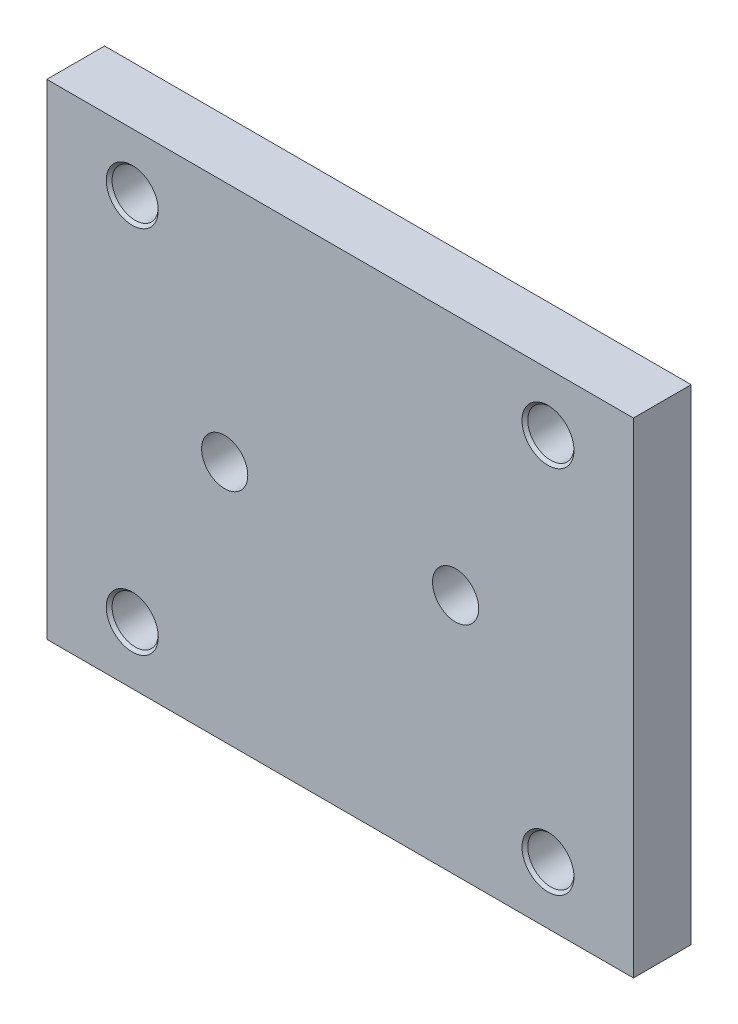
ISO-10303-21;
HEADER;
FILE_DESCRIPTION(('STEP AP214'),'2;1');
FILE_NAME('part.step','',(''),(''),'','','');
FILE_SCHEMA(('AUTOMOTIVE_DESIGN { 1 0 10303 214 1 1 1 1 }'));
ENDSEC;
DATA;
#1=APPLICATION_CONTEXT('core data for automotive mechanical design processes');
#2=APPLICATION_PROTOCOL_DEFINITION('international standard','automotive_design',2000,#1);
#3=PRODUCT_CONTEXT('',#1,'mechanical');
#4=PRODUCT('Part','Part','',(#3));
#5=PRODUCT_RELATED_PRODUCT_CATEGORY('part','',(#4));
#6=PRODUCT_DEFINITION_FORMATION('','',#4);
#7=PRODUCT_DEFINITION_CONTEXT('part definition',#1,'design');
#8=PRODUCT_DEFINITION('design','',#6,#7);
#9=PRODUCT_DEFINITION_SHAPE('','',#8);
#10=(LENGTH_UNIT() NAMED_UNIT(*) SI_UNIT(.MILLI.,.METRE.));
#11=(NAMED_UNIT(*) PLANE_ANGLE_UNIT() SI_UNIT($,.RADIAN.));
#12=(NAMED_UNIT(*) SI_UNIT($,.STERADIAN.) SOLID_ANGLE_UNIT());
#13=UNCERTAINTY_MEASURE_WITH_UNIT(LENGTH_MEASURE(1.E-05),#10,'distance_accuracy_value','');
#14=(GEOMETRIC_REPRESENTATION_CONTEXT(3) GLOBAL_UNCERTAINTY_ASSIGNED_CONTEXT((#13)) GLOBAL_UNIT_ASSIGNED_CONTEXT((#10,
#11,#12)) REPRESENTATION_CONTEXT('',''));
#15=CARTESIAN_POINT('',(0.,0.,0.));
#16=DIRECTION('',(0.,0.,1.));
#17=DIRECTION('',(1.,0.,0.));
#18=AXIS2_PLACEMENT_3D('',#15,#16,#17);
#19=CARTESIAN_POINT('',(0.,0.,25.));
#20=DIRECTION('',(0.,0.,1.));
#21=DIRECTION('',(1.,0.,0.));
#22=AXIS2_PLACEMENT_3D('',#19,#20,#21);
#23=PLANE('',#22);
#24=CARTESIAN_POINT('',(-90.,-79.9999999999998,25.));
#25=DIRECTION('',(0.,0.,1.));
#26=DIRECTION('',(1.,0.,0.));
#27=AXIS2_PLACEMENT_3D('',#24,#25,#26);
#28=CIRCLE('',#27,11.25);
#29=CARTESIAN_POINT('',(-78.75,-79.9999999999998,25.));
#30=VERTEX_POINT('',#29);
#31=EDGE_CURVE('E183',#30,#30,#28,.T.);
#32=ORIENTED_EDGE('',*,*,#31,.F.);
#33=EDGE_LOOP('',(#32));
#34=FACE_BOUND('',#33,.T.);
#35=CARTESIAN_POINT('',(90.,-79.9999999999998,25.));
#36=DIRECTION('',(0.,0.,1.));
#37=DIRECTION('',(1.,0.,0.));
#38=AXIS2_PLACEMENT_3D('',#35,#36,#37);
#39=CIRCLE('',#38,11.25);
#40=CARTESIAN_POINT('',(101.25,-79.9999999999998,25.));
#41=VERTEX_POINT('',#40);
#42=EDGE_CURVE('E187',#41,#41,#39,.T.);
#43=ORIENTED_EDGE('',*,*,#42,.F.);
#44=EDGE_LOOP('',(#43));
#45=FACE_BOUND('',#44,.T.);
#46=CARTESIAN_POINT('',(90.,80.0000000000002,25.));
#47=DIRECTION('',(0.,0.,1.));
#48=DIRECTION('',(1.,0.,0.));
#49=AXIS2_PLACEMENT_3D('',#46,#47,#48);
#50=CIRCLE('',#49,11.25);
#51=CARTESIAN_POINT('',(101.25,80.0000000000002,25.));
#52=VERTEX_POINT('',#51);
#53=EDGE_CURVE('E182',#52,#52,#50,.T.);
#54=ORIENTED_EDGE('',*,*,#53,.F.);
#55=EDGE_LOOP('',(#54));
#56=FACE_BOUND('',#55,.T.);
#57=CARTESIAN_POINT('',(-90.,80.0000000000002,25.));
#58=DIRECTION('',(0.,0.,1.));
#59=DIRECTION('',(1.,0.,0.));
#60=AXIS2_PLACEMENT_3D('',#57,#58,#59);
#61=CIRCLE('',#60,11.25);
#62=CARTESIAN_POINT('',(-78.75,80.0000000000002,25.));
#63=VERTEX_POINT('',#62);
#64=EDGE_CURVE('E130',#63,#63,#61,.T.);
#65=ORIENTED_EDGE('',*,*,#64,.F.);
#66=EDGE_LOOP('',(#65));
#67=FACE_BOUND('',#66,.T.);
#68=CARTESIAN_POINT('',(-50.,0.,25.));
#69=DIRECTION('',(0.,0.,1.));
#70=DIRECTION('',(1.,0.,0.));
#71=AXIS2_PLACEMENT_3D('',#68,#69,#70);
#72=CIRCLE('',#71,10.);
#73=CARTESIAN_POINT('',(-40.,0.,25.));
#74=VERTEX_POINT('',#73);
#75=EDGE_CURVE('E151',#74,#74,#72,.T.);
#76=ORIENTED_EDGE('',*,*,#75,.F.);
#77=EDGE_LOOP('',(#76));
#78=FACE_BOUND('',#77,.T.);
#79=CARTESIAN_POINT('',(50.,0.,25.));
#80=DIRECTION('',(0.,0.,1.));
#81=DIRECTION('',(1.,0.,0.));
#82=AXIS2_PLACEMENT_3D('',#79,#80,#81);
#83=CIRCLE('',#82,10.);
#84=CARTESIAN_POINT('',(60.,0.,25.));
#85=VERTEX_POINT('',#84);
#86=EDGE_CURVE('E140',#85,#85,#83,.T.);
#87=ORIENTED_EDGE('',*,*,#86,.F.);
#88=EDGE_LOOP('',(#87));
#89=FACE_BOUND('',#88,.T.);
#90=DIRECTION('',(0.,-1.,0.));
#91=VECTOR('',#90,1.);
#92=CARTESIAN_POINT('',(-127.,105.,25.));
#93=LINE('',#92,#91);
#94=CARTESIAN_POINT('',(-127.,105.,25.));
#95=VERTEX_POINT('',#94);
#96=CARTESIAN_POINT('',(-127.,-105.,25.));
#97=VERTEX_POINT('',#96);
#98=EDGE_CURVE('E93',#95,#97,#93,.T.);
#99=ORIENTED_EDGE('',*,*,#98,.T.);
#100=DIRECTION('',(1.,0.,0.));
#101=VECTOR('',#100,1.);
#102=CARTESIAN_POINT('',(-127.,-105.,25.));
#103=LINE('',#102,#101);
#104=CARTESIAN_POINT('',(127.,-105.,25.));
#105=VERTEX_POINT('',#104);
#106=EDGE_CURVE('E89',#97,#105,#103,.T.);
#107=ORIENTED_EDGE('',*,*,#106,.T.);
#108=DIRECTION('',(0.,1.,0.));
#109=VECTOR('',#108,1.);
#110=CARTESIAN_POINT('',(127.,105.,25.));
#111=LINE('',#110,#109);
#112=CARTESIAN_POINT('',(127.,105.,25.));
#113=VERTEX_POINT('',#112);
#114=EDGE_CURVE('E91',#105,#113,#111,.T.);
#115=ORIENTED_EDGE('',*,*,#114,.T.);
#116=DIRECTION('',(-1.,0.,0.));
#117=VECTOR('',#116,1.);
#118=CARTESIAN_POINT('',(-127.,105.,25.));
#119=LINE('',#118,#117);
#120=EDGE_CURVE('E59',#113,#95,#119,.T.);
#121=ORIENTED_EDGE('',*,*,#120,.T.);
#122=EDGE_LOOP('',(#99,#107,#115,#121));
#123=FACE_BOUND('',#122,.T.);
#124=ADVANCED_FACE('F39',(#34,#45,#56,#67,#78,#89,#123),#23,.T.);
#125=CARTESIAN_POINT('',(0.,0.,0.));
#126=DIRECTION('',(0.,0.,1.));
#127=DIRECTION('',(1.,0.,0.));
#128=AXIS2_PLACEMENT_3D('',#125,#126,#127);
#129=PLANE('',#128);
#130=CARTESIAN_POINT('',(-50.,0.,0.));
#131=DIRECTION('',(0.,0.,1.));
#132=DIRECTION('',(1.,0.,0.));
#133=AXIS2_PLACEMENT_3D('',#130,#131,#132);
#134=CIRCLE('',#133,10.);
#135=CARTESIAN_POINT('',(-40.,0.,0.));
#136=VERTEX_POINT('',#135);
#137=EDGE_CURVE('E154',#136,#136,#134,.F.);
#138=ORIENTED_EDGE('',*,*,#137,.F.);
#139=EDGE_LOOP('',(#138));
#140=FACE_BOUND('',#139,.T.);
#141=CARTESIAN_POINT('',(50.,0.,0.));
#142=DIRECTION('',(0.,0.,1.));
#143=DIRECTION('',(1.,0.,0.));
#144=AXIS2_PLACEMENT_3D('',#141,#142,#143);
#145=CIRCLE('',#144,10.);
#146=CARTESIAN_POINT('',(60.,0.,0.));
#147=VERTEX_POINT('',#146);
#148=EDGE_CURVE('E145',#147,#147,#145,.F.);
#149=ORIENTED_EDGE('',*,*,#148,.F.);
#150=EDGE_LOOP('',(#149));
#151=FACE_BOUND('',#150,.T.);
#152=DIRECTION('',(0.,-1.,0.));
#153=VECTOR('',#152,1.);
#154=CARTESIAN_POINT('',(-127.,105.,0.));
#155=LINE('',#154,#153);
#156=CARTESIAN_POINT('',(-127.,105.,0.));
#157=VERTEX_POINT('',#156);
#158=CARTESIAN_POINT('',(-127.,-105.,0.));
#159=VERTEX_POINT('',#158);
#160=EDGE_CURVE('E110',#157,#159,#155,.T.);
#161=ORIENTED_EDGE('',*,*,#160,.F.);
#162=DIRECTION('',(-1.,0.,0.));
#163=VECTOR('',#162,1.);
#164=CARTESIAN_POINT('',(-127.,105.,0.));
#165=LINE('',#164,#163);
#166=CARTESIAN_POINT('',(127.,105.,0.));
#167=VERTEX_POINT('',#166);
#168=EDGE_CURVE('E82',#167,#157,#165,.T.);
#169=ORIENTED_EDGE('',*,*,#168,.F.);
#170=DIRECTION('',(0.,1.,0.));
#171=VECTOR('',#170,1.);
#172=CARTESIAN_POINT('',(127.,105.,0.));
#173=LINE('',#172,#171);
#174=CARTESIAN_POINT('',(127.,-105.,0.));
#175=VERTEX_POINT('',#174);
#176=EDGE_CURVE('E76',#175,#167,#173,.T.);
#177=ORIENTED_EDGE('',*,*,#176,.F.);
#178=DIRECTION('',(1.,0.,0.));
#179=VECTOR('',#178,1.);
#180=CARTESIAN_POINT('',(-127.,-105.,0.));
#181=LINE('',#180,#179);
#182=EDGE_CURVE('E98',#159,#175,#181,.T.);
#183=ORIENTED_EDGE('',*,*,#182,.F.);
#184=EDGE_LOOP('',(#161,#169,#177,#183));
#185=FACE_BOUND('',#184,.T.);
#186=CARTESIAN_POINT('',(-90.,80.0000000000002,0.));
#187=DIRECTION('',(0.,0.,1.));
#188=DIRECTION('',(1.,0.,0.));
#189=AXIS2_PLACEMENT_3D('',#186,#187,#188);
#190=CIRCLE('',#189,9.99999999999999);
#191=CARTESIAN_POINT('',(-80.,80.0000000000002,0.));
#192=VERTEX_POINT('',#191);
#193=EDGE_CURVE('E114',#192,#192,#190,.T.);
#194=ORIENTED_EDGE('',*,*,#193,.T.);
#195=EDGE_LOOP('',(#194));
#196=FACE_BOUND('',#195,.T.);
#197=CARTESIAN_POINT('',(90.,80.0000000000002,0.));
#198=DIRECTION('',(0.,0.,1.));
#199=DIRECTION('',(1.,0.,0.));
#200=AXIS2_PLACEMENT_3D('',#197,#198,#199);
#201=CIRCLE('',#200,9.99999999999999);
#202=CARTESIAN_POINT('',(100.,80.0000000000002,0.));
#203=VERTEX_POINT('',#202);
#204=EDGE_CURVE('E165',#203,#203,#201,.T.);
#205=ORIENTED_EDGE('',*,*,#204,.T.);
#206=EDGE_LOOP('',(#205));
#207=FACE_BOUND('',#206,.T.);
#208=CARTESIAN_POINT('',(90.,-79.9999999999998,0.));
#209=DIRECTION('',(0.,0.,1.));
#210=DIRECTION('',(1.,0.,0.));
#211=AXIS2_PLACEMENT_3D('',#208,#209,#210);
#212=CIRCLE('',#211,9.99999999999999);
#213=CARTESIAN_POINT('',(100.,-79.9999999999998,0.));
#214=VERTEX_POINT('',#213);
#215=EDGE_CURVE('E161',#214,#214,#212,.T.);
#216=ORIENTED_EDGE('',*,*,#215,.T.);
#217=EDGE_LOOP('',(#216));
#218=FACE_BOUND('',#217,.T.);
#219=CARTESIAN_POINT('',(-90.,-79.9999999999998,0.));
#220=DIRECTION('',(0.,0.,1.));
#221=DIRECTION('',(1.,0.,0.));
#222=AXIS2_PLACEMENT_3D('',#219,#220,#221);
#223=CIRCLE('',#222,9.99999999999999);
#224=CARTESIAN_POINT('',(-80.,-79.9999999999998,0.));
#225=VERTEX_POINT('',#224);
#226=EDGE_CURVE('E157',#225,#225,#223,.T.);
#227=ORIENTED_EDGE('',*,*,#226,.T.);
#228=EDGE_LOOP('',(#227));
#229=FACE_BOUND('',#228,.T.);
#230=ADVANCED_FACE('F199',(#140,#151,#185,#196,#207,#218,#229),#129,.F.);
#231=CARTESIAN_POINT('',(-127.,105.,25.));
#232=DIRECTION('',(1.,0.,0.));
#233=DIRECTION('',(0.,1.,0.));
#234=AXIS2_PLACEMENT_3D('',#231,#232,#233);
#235=PLANE('',#234);
#236=ORIENTED_EDGE('',*,*,#160,.T.);
#237=DIRECTION('',(0.,0.,-1.));
#238=VECTOR('',#237,1.);
#239=CARTESIAN_POINT('',(-127.,-105.,25.));
#240=LINE('',#239,#238);
#241=EDGE_CURVE('E11',#97,#159,#240,.T.);
#242=ORIENTED_EDGE('',*,*,#241,.F.);
#243=ORIENTED_EDGE('',*,*,#98,.F.);
#244=DIRECTION('',(0.,0.,-1.));
#245=VECTOR('',#244,1.);
#246=CARTESIAN_POINT('',(-127.,105.,25.));
#247=LINE('',#246,#245);
#248=EDGE_CURVE('E106',#95,#157,#247,.T.);
#249=ORIENTED_EDGE('',*,*,#248,.T.);
#250=EDGE_LOOP('',(#236,#242,#243,#249));
#251=FACE_BOUND('',#250,.T.);
#252=ADVANCED_FACE('F41',(#251),#235,.F.);
#253=CARTESIAN_POINT('',(-127.,-105.,25.));
#254=DIRECTION('',(0.,1.,0.));
#255=DIRECTION('',(0.,0.,1.));
#256=AXIS2_PLACEMENT_3D('',#253,#254,#255);
#257=PLANE('',#256);
#258=ORIENTED_EDGE('',*,*,#182,.T.);
#259=DIRECTION('',(0.,0.,-1.));
#260=VECTOR('',#259,1.);
#261=CARTESIAN_POINT('',(127.,-105.,25.));
#262=LINE('',#261,#260);
#263=EDGE_CURVE('E50',#105,#175,#262,.T.);
#264=ORIENTED_EDGE('',*,*,#263,.F.);
#265=ORIENTED_EDGE('',*,*,#106,.F.);
#266=ORIENTED_EDGE('',*,*,#241,.T.);
#267=EDGE_LOOP('',(#258,#264,#265,#266));
#268=FACE_BOUND('',#267,.T.);
#269=ADVANCED_FACE('F97',(#268),#257,.F.);
#270=CARTESIAN_POINT('',(127.,105.,25.));
#271=DIRECTION('',(-1.,0.,0.));
#272=DIRECTION('',(0.,-1.,0.));
#273=AXIS2_PLACEMENT_3D('',#270,#271,#272);
#274=PLANE('',#273);
#275=ORIENTED_EDGE('',*,*,#176,.T.);
#276=DIRECTION('',(0.,0.,-1.));
#277=VECTOR('',#276,1.);
#278=CARTESIAN_POINT('',(127.,105.,25.));
#279=LINE('',#278,#277);
#280=EDGE_CURVE('E100',#113,#167,#279,.T.);
#281=ORIENTED_EDGE('',*,*,#280,.F.);
#282=ORIENTED_EDGE('',*,*,#114,.F.);
#283=ORIENTED_EDGE('',*,*,#263,.T.);
#284=EDGE_LOOP('',(#275,#281,#282,#283));
#285=FACE_BOUND('',#284,.T.);
#286=ADVANCED_FACE('F102',(#285),#274,.F.);
#287=CARTESIAN_POINT('',(-127.,105.,25.));
#288=DIRECTION('',(0.,-1.,0.));
#289=DIRECTION('',(1.,0.,0.));
#290=AXIS2_PLACEMENT_3D('',#287,#288,#289);
#291=PLANE('',#290);
#292=ORIENTED_EDGE('',*,*,#168,.T.);
#293=ORIENTED_EDGE('',*,*,#248,.F.);
#294=ORIENTED_EDGE('',*,*,#120,.F.);
#295=ORIENTED_EDGE('',*,*,#280,.T.);
#296=EDGE_LOOP('',(#292,#293,#294,#295));
#297=FACE_BOUND('',#296,.T.);
#298=ADVANCED_FACE('F238',(#297),#291,.F.);
#299=CARTESIAN_POINT('',(-90.,80.0000000000002,25.));
#300=DIRECTION('',(0.,0.,-1.));
#301=DIRECTION('',(-1.,0.,0.));
#302=AXIS2_PLACEMENT_3D('',#299,#300,#301);
#303=CYLINDRICAL_SURFACE('',#302,9.99999999999999);
#304=CARTESIAN_POINT('',(-90.,80.0000000000002,23.75));
#305=DIRECTION('',(0.,0.,1.));
#306=DIRECTION('',(1.,0.,0.));
#307=AXIS2_PLACEMENT_3D('',#304,#305,#306);
#308=CIRCLE('',#307,9.99999999999999);
#309=CARTESIAN_POINT('',(-80.,80.0000000000002,23.75));
#310=VERTEX_POINT('',#309);
#311=EDGE_CURVE('E43',#310,#310,#308,.F.);
#312=ORIENTED_EDGE('',*,*,#311,.F.);
#313=EDGE_LOOP('',(#312));
#314=FACE_BOUND('',#313,.T.);
#315=ORIENTED_EDGE('',*,*,#193,.F.);
#316=EDGE_LOOP('',(#315));
#317=FACE_BOUND('',#316,.T.);
#318=ADVANCED_FACE('F235',(#314,#317),#303,.F.);
#319=CARTESIAN_POINT('',(90.,80.0000000000002,25.));
#320=DIRECTION('',(0.,0.,-1.));
#321=DIRECTION('',(-1.,0.,0.));
#322=AXIS2_PLACEMENT_3D('',#319,#320,#321);
#323=CYLINDRICAL_SURFACE('',#322,9.99999999999999);
#324=CARTESIAN_POINT('',(90.,80.0000000000002,23.75));
#325=DIRECTION('',(0.,0.,1.));
#326=DIRECTION('',(1.,0.,0.));
#327=AXIS2_PLACEMENT_3D('',#324,#325,#326);
#328=CIRCLE('',#327,9.99999999999999);
#329=CARTESIAN_POINT('',(100.,80.0000000000002,23.75));
#330=VERTEX_POINT('',#329);
#331=EDGE_CURVE('E133',#330,#330,#328,.F.);
#332=ORIENTED_EDGE('',*,*,#331,.F.);
#333=EDGE_LOOP('',(#332));
#334=FACE_BOUND('',#333,.T.);
#335=ORIENTED_EDGE('',*,*,#204,.F.);
#336=EDGE_LOOP('',(#335));
#337=FACE_BOUND('',#336,.T.);
#338=ADVANCED_FACE('F231',(#334,#337),#323,.F.);
#339=CARTESIAN_POINT('',(90.,-79.9999999999998,25.));
#340=DIRECTION('',(0.,0.,-1.));
#341=DIRECTION('',(-1.,0.,0.));
#342=AXIS2_PLACEMENT_3D('',#339,#340,#341);
#343=CYLINDRICAL_SURFACE('',#342,9.99999999999999);
#344=CARTESIAN_POINT('',(90.,-79.9999999999998,23.75));
#345=DIRECTION('',(0.,0.,1.));
#346=DIRECTION('',(1.,0.,0.));
#347=AXIS2_PLACEMENT_3D('',#344,#345,#346);
#348=CIRCLE('',#347,9.99999999999999);
#349=CARTESIAN_POINT('',(100.,-79.9999999999998,23.75));
#350=VERTEX_POINT('',#349);
#351=EDGE_CURVE('E129',#350,#350,#348,.F.);
#352=ORIENTED_EDGE('',*,*,#351,.F.);
#353=EDGE_LOOP('',(#352));
#354=FACE_BOUND('',#353,.T.);
#355=ORIENTED_EDGE('',*,*,#215,.F.);
#356=EDGE_LOOP('',(#355));
#357=FACE_BOUND('',#356,.T.);
#358=ADVANCED_FACE('F227',(#354,#357),#343,.F.);
#359=CARTESIAN_POINT('',(-90.,-79.9999999999998,25.));
#360=DIRECTION('',(0.,0.,-1.));
#361=DIRECTION('',(-1.,0.,0.));
#362=AXIS2_PLACEMENT_3D('',#359,#360,#361);
#363=CYLINDRICAL_SURFACE('',#362,9.99999999999999);
#364=CARTESIAN_POINT('',(-90.,-79.9999999999998,23.75));
#365=DIRECTION('',(0.,0.,1.));
#366=DIRECTION('',(1.,0.,0.));
#367=AXIS2_PLACEMENT_3D('',#364,#365,#366);
#368=CIRCLE('',#367,9.99999999999999);
#369=CARTESIAN_POINT('',(-80.,-79.9999999999998,23.75));
#370=VERTEX_POINT('',#369);
#371=EDGE_CURVE('E125',#370,#370,#368,.F.);
#372=ORIENTED_EDGE('',*,*,#371,.F.);
#373=EDGE_LOOP('',(#372));
#374=FACE_BOUND('',#373,.T.);
#375=ORIENTED_EDGE('',*,*,#226,.F.);
#376=EDGE_LOOP('',(#375));
#377=FACE_BOUND('',#376,.T.);
#378=ADVANCED_FACE('F224',(#374,#377),#363,.F.);
#379=CARTESIAN_POINT('',(50.,0.,-0.001000000000001));
#380=DIRECTION('',(0.,0.,1.));
#381=DIRECTION('',(1.,0.,0.));
#382=AXIS2_PLACEMENT_3D('',#379,#380,#381);
#383=CYLINDRICAL_SURFACE('',#382,10.);
#384=ORIENTED_EDGE('',*,*,#86,.T.);
#385=EDGE_LOOP('',(#384));
#386=FACE_BOUND('',#385,.T.);
#387=ORIENTED_EDGE('',*,*,#148,.T.);
#388=EDGE_LOOP('',(#387));
#389=FACE_BOUND('',#388,.T.);
#390=ADVANCED_FACE('F221',(#386,#389),#383,.F.);
#391=CARTESIAN_POINT('',(-50.,0.,-0.001000000000001));
#392=DIRECTION('',(0.,0.,1.));
#393=DIRECTION('',(1.,0.,0.));
#394=AXIS2_PLACEMENT_3D('',#391,#392,#393);
#395=CYLINDRICAL_SURFACE('',#394,10.);
#396=ORIENTED_EDGE('',*,*,#75,.T.);
#397=EDGE_LOOP('',(#396));
#398=FACE_BOUND('',#397,.T.);
#399=ORIENTED_EDGE('',*,*,#137,.T.);
#400=EDGE_LOOP('',(#399));
#401=FACE_BOUND('',#400,.T.);
#402=ADVANCED_FACE('F218',(#398,#401),#395,.F.);
#403=CARTESIAN_POINT('',(-90.,-79.9999999999998,25.));
#404=DIRECTION('',(0.,0.,1.));
#405=DIRECTION('',(1.,0.,0.));
#406=AXIS2_PLACEMENT_3D('',#403,#404,#405);
#407=CONICAL_SURFACE('',#406,11.25,0.78539816339745);
#408=ORIENTED_EDGE('',*,*,#371,.T.);
#409=EDGE_LOOP('',(#408));
#410=FACE_BOUND('',#409,.T.);
#411=ORIENTED_EDGE('',*,*,#31,.T.);
#412=EDGE_LOOP('',(#411));
#413=FACE_BOUND('',#412,.T.);
#414=ADVANCED_FACE('F216',(#410,#413),#407,.F.);
#415=CARTESIAN_POINT('',(90.,-79.9999999999998,25.));
#416=DIRECTION('',(0.,0.,1.));
#417=DIRECTION('',(1.,0.,0.));
#418=AXIS2_PLACEMENT_3D('',#415,#416,#417);
#419=CONICAL_SURFACE('',#418,11.25,0.78539816339745);
#420=ORIENTED_EDGE('',*,*,#351,.T.);
#421=EDGE_LOOP('',(#420));
#422=FACE_BOUND('',#421,.T.);
#423=ORIENTED_EDGE('',*,*,#42,.T.);
#424=EDGE_LOOP('',(#423));
#425=FACE_BOUND('',#424,.T.);
#426=ADVANCED_FACE('F212',(#422,#425),#419,.F.);
#427=CARTESIAN_POINT('',(90.,80.0000000000002,25.));
#428=DIRECTION('',(0.,0.,1.));
#429=DIRECTION('',(1.,0.,0.));
#430=AXIS2_PLACEMENT_3D('',#427,#428,#429);
#431=CONICAL_SURFACE('',#430,11.25,0.78539816339745);
#432=ORIENTED_EDGE('',*,*,#331,.T.);
#433=EDGE_LOOP('',(#432));
#434=FACE_BOUND('',#433,.T.);
#435=ORIENTED_EDGE('',*,*,#53,.T.);
#436=EDGE_LOOP('',(#435));
#437=FACE_BOUND('',#436,.T.);
#438=ADVANCED_FACE('F195',(#434,#437),#431,.F.);
#439=CARTESIAN_POINT('',(-90.,80.0000000000002,25.));
#440=DIRECTION('',(0.,0.,1.));
#441=DIRECTION('',(1.,0.,0.));
#442=AXIS2_PLACEMENT_3D('',#439,#440,#441);
#443=CONICAL_SURFACE('',#442,11.25,0.78539816339745);
#444=ORIENTED_EDGE('',*,*,#311,.T.);
#445=EDGE_LOOP('',(#444));
#446=FACE_BOUND('',#445,.T.);
#447=ORIENTED_EDGE('',*,*,#64,.T.);
#448=EDGE_LOOP('',(#447));
#449=FACE_BOUND('',#448,.T.);
#450=ADVANCED_FACE('F206',(#446,#449),#443,.F.);
#451=CLOSED_SHELL('',(#124,#230,#252,#269,#286,#298,#318,#338,#358,#378,#390,#402,#414,#426,
#438,#450));
#452=MANIFOLD_SOLID_BREP('B2',#451);
#453=ADVANCED_BREP_SHAPE_REPRESENTATION('',(#18,#452),#14);
#454=SHAPE_DEFINITION_REPRESENTATION(#9,#453);
ENDSEC;
END-ISO-10303-21;
